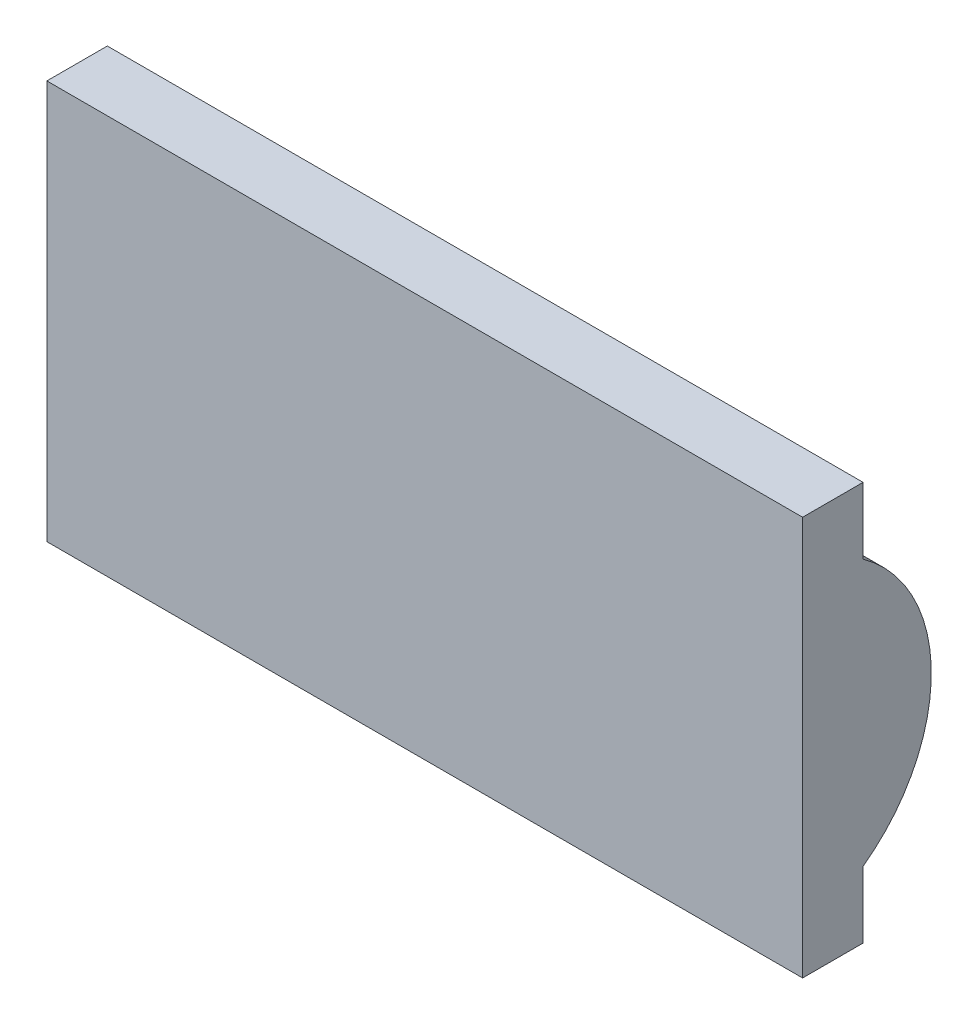
ISO-10303-21;
HEADER;
FILE_DESCRIPTION(('STEP AP214'),'2;1');
FILE_NAME('part.step','',(''),(''),'','','');
FILE_SCHEMA(('AUTOMOTIVE_DESIGN { 1 0 10303 214 1 1 1 1 }'));
ENDSEC;
DATA;
#1=APPLICATION_CONTEXT('core data for automotive mechanical design processes');
#2=APPLICATION_PROTOCOL_DEFINITION('international standard','automotive_design',2000,#1);
#3=PRODUCT_CONTEXT('',#1,'mechanical');
#4=PRODUCT('Part','Part','',(#3));
#5=PRODUCT_RELATED_PRODUCT_CATEGORY('part','',(#4));
#6=PRODUCT_DEFINITION_FORMATION('','',#4);
#7=PRODUCT_DEFINITION_CONTEXT('part definition',#1,'design');
#8=PRODUCT_DEFINITION('design','',#6,#7);
#9=PRODUCT_DEFINITION_SHAPE('','',#8);
#10=(LENGTH_UNIT() NAMED_UNIT(*) SI_UNIT(.MILLI.,.METRE.));
#11=(NAMED_UNIT(*) PLANE_ANGLE_UNIT() SI_UNIT($,.RADIAN.));
#12=(NAMED_UNIT(*) SI_UNIT($,.STERADIAN.) SOLID_ANGLE_UNIT());
#13=UNCERTAINTY_MEASURE_WITH_UNIT(LENGTH_MEASURE(1.E-05),#10,'distance_accuracy_value','');
#14=(GEOMETRIC_REPRESENTATION_CONTEXT(3) GLOBAL_UNCERTAINTY_ASSIGNED_CONTEXT((#13)) GLOBAL_UNIT_ASSIGNED_CONTEXT((#10,
#11,#12)) REPRESENTATION_CONTEXT('',''));
#15=CARTESIAN_POINT('',(0.,0.,0.));
#16=DIRECTION('',(0.,0.,1.));
#17=DIRECTION('',(1.,0.,0.));
#18=AXIS2_PLACEMENT_3D('',#15,#16,#17);
#19=CARTESIAN_POINT('',(62.5,25.6884446982676,0.));
#20=DIRECTION('',(0.,-1.,0.));
#21=DIRECTION('',(0.,0.,-1.));
#22=AXIS2_PLACEMENT_3D('',#19,#20,#21);
#23=PLANE('',#22);
#24=DIRECTION('',(0.,0.,1.));
#25=VECTOR('',#24,1.);
#26=CARTESIAN_POINT('',(0.,25.6884446982676,0.));
#27=LINE('',#26,#25);
#28=CARTESIAN_POINT('',(0.,25.6884446982676,-5.));
#29=VERTEX_POINT('',#28);
#30=CARTESIAN_POINT('',(0.,25.6884446982676,0.));
#31=VERTEX_POINT('',#30);
#32=EDGE_CURVE('E119',#29,#31,#27,.T.);
#33=ORIENTED_EDGE('',*,*,#32,.T.);
#34=DIRECTION('',(-1.,0.,0.));
#35=VECTOR('',#34,1.);
#36=CARTESIAN_POINT('',(62.5,25.6884446982676,0.));
#37=LINE('',#36,#35);
#38=CARTESIAN_POINT('',(62.5,25.6884446982676,0.));
#39=VERTEX_POINT('',#38);
#40=EDGE_CURVE('E11',#39,#31,#37,.T.);
#41=ORIENTED_EDGE('',*,*,#40,.F.);
#42=DIRECTION('',(0.,0.,1.));
#43=VECTOR('',#42,1.);
#44=CARTESIAN_POINT('',(62.5,25.6884446982676,0.));
#45=LINE('',#44,#43);
#46=CARTESIAN_POINT('',(62.5,25.6884446982676,-5.));
#47=VERTEX_POINT('',#46);
#48=EDGE_CURVE('E129',#47,#39,#45,.T.);
#49=ORIENTED_EDGE('',*,*,#48,.F.);
#50=DIRECTION('',(-1.,0.,0.));
#51=VECTOR('',#50,1.);
#52=CARTESIAN_POINT('',(62.5,25.6884446982676,-5.));
#53=LINE('',#52,#51);
#54=EDGE_CURVE('E115',#47,#29,#53,.T.);
#55=ORIENTED_EDGE('',*,*,#54,.T.);
#56=EDGE_LOOP('',(#33,#41,#49,#55));
#57=FACE_BOUND('',#56,.T.);
#58=ADVANCED_FACE('F35',(#57),#23,.F.);
#59=CARTESIAN_POINT('',(62.5,25.6884446982676,0.));
#60=DIRECTION('',(0.,0.,-1.));
#61=DIRECTION('',(0.,1.,0.));
#62=AXIS2_PLACEMENT_3D('',#59,#60,#61);
#63=PLANE('',#62);
#64=DIRECTION('',(0.,-1.,0.));
#65=VECTOR('',#64,1.);
#66=CARTESIAN_POINT('',(0.,25.6884446982676,0.));
#67=LINE('',#66,#65);
#68=CARTESIAN_POINT('',(0.,-7.31155530173237,0.));
#69=VERTEX_POINT('',#68);
#70=EDGE_CURVE('E122',#31,#69,#67,.T.);
#71=ORIENTED_EDGE('',*,*,#70,.T.);
#72=DIRECTION('',(-1.,0.,0.));
#73=VECTOR('',#72,1.);
#74=CARTESIAN_POINT('',(62.5,-7.31155530173237,0.));
#75=LINE('',#74,#73);
#76=CARTESIAN_POINT('',(62.5,-7.31155530173237,0.));
#77=VERTEX_POINT('',#76);
#78=EDGE_CURVE('E43',#77,#69,#75,.T.);
#79=ORIENTED_EDGE('',*,*,#78,.F.);
#80=DIRECTION('',(0.,-1.,0.));
#81=VECTOR('',#80,1.);
#82=CARTESIAN_POINT('',(62.5,25.6884446982676,0.));
#83=LINE('',#82,#81);
#84=EDGE_CURVE('E88',#39,#77,#83,.T.);
#85=ORIENTED_EDGE('',*,*,#84,.F.);
#86=ORIENTED_EDGE('',*,*,#40,.T.);
#87=EDGE_LOOP('',(#71,#79,#85,#86));
#88=FACE_BOUND('',#87,.T.);
#89=ADVANCED_FACE('F153',(#88),#63,.F.);
#90=CARTESIAN_POINT('',(62.5,-7.31155530173237,0.));
#91=DIRECTION('',(0.,1.,0.));
#92=DIRECTION('',(0.,0.,1.));
#93=AXIS2_PLACEMENT_3D('',#90,#91,#92);
#94=PLANE('',#93);
#95=DIRECTION('',(0.,0.,-1.));
#96=VECTOR('',#95,1.);
#97=CARTESIAN_POINT('',(0.,-7.31155530173237,0.));
#98=LINE('',#97,#96);
#99=CARTESIAN_POINT('',(0.,-7.31155530173237,-5.));
#100=VERTEX_POINT('',#99);
#101=EDGE_CURVE('E124',#69,#100,#98,.T.);
#102=ORIENTED_EDGE('',*,*,#101,.T.);
#103=DIRECTION('',(-1.,0.,0.));
#104=VECTOR('',#103,1.);
#105=CARTESIAN_POINT('',(62.5,-7.31155530173237,-5.));
#106=LINE('',#105,#104);
#107=CARTESIAN_POINT('',(62.5,-7.31155530173237,-5.));
#108=VERTEX_POINT('',#107);
#109=EDGE_CURVE('E110',#108,#100,#106,.T.);
#110=ORIENTED_EDGE('',*,*,#109,.F.);
#111=DIRECTION('',(0.,0.,-1.));
#112=VECTOR('',#111,1.);
#113=CARTESIAN_POINT('',(62.5,-7.31155530173237,0.));
#114=LINE('',#113,#112);
#115=EDGE_CURVE('E101',#77,#108,#114,.T.);
#116=ORIENTED_EDGE('',*,*,#115,.F.);
#117=ORIENTED_EDGE('',*,*,#78,.T.);
#118=EDGE_LOOP('',(#102,#110,#116,#117));
#119=FACE_BOUND('',#118,.T.);
#120=ADVANCED_FACE('F135',(#119),#94,.F.);
#121=CARTESIAN_POINT('',(62.5,-7.31155530173237,-5.));
#122=DIRECTION('',(0.,0.,1.));
#123=DIRECTION('',(1.,0.,0.));
#124=AXIS2_PLACEMENT_3D('',#121,#122,#123);
#125=PLANE('',#124);
#126=DIRECTION('',(0.,1.,0.));
#127=VECTOR('',#126,1.);
#128=CARTESIAN_POINT('',(0.,-7.31155530173237,-5.));
#129=LINE('',#128,#127);
#130=CARTESIAN_POINT('',(0.,-1.81155530173237,-5.));
#131=VERTEX_POINT('',#130);
#132=EDGE_CURVE('E109',#100,#131,#129,.T.);
#133=ORIENTED_EDGE('',*,*,#132,.T.);
#134=DIRECTION('',(-1.,0.,0.));
#135=VECTOR('',#134,1.);
#136=CARTESIAN_POINT('',(62.5,-1.81155530173237,-5.));
#137=LINE('',#136,#135);
#138=CARTESIAN_POINT('',(62.5,-1.81155530173237,-5.));
#139=VERTEX_POINT('',#138);
#140=EDGE_CURVE('E106',#139,#131,#137,.T.);
#141=ORIENTED_EDGE('',*,*,#140,.F.);
#142=DIRECTION('',(0.,1.,0.));
#143=VECTOR('',#142,1.);
#144=CARTESIAN_POINT('',(62.5,-7.31155530173237,-5.));
#145=LINE('',#144,#143);
#146=EDGE_CURVE('E95',#108,#139,#145,.T.);
#147=ORIENTED_EDGE('',*,*,#146,.F.);
#148=ORIENTED_EDGE('',*,*,#109,.T.);
#149=EDGE_LOOP('',(#133,#141,#147,#148));
#150=FACE_BOUND('',#149,.T.);
#151=ADVANCED_FACE('F107',(#150),#125,.F.);
#152=CARTESIAN_POINT('',(62.5,9.18844469826763,2.90089764698066));
#153=DIRECTION('',(-1.,0.,0.));
#154=DIRECTION('',(0.,0.,1.));
#155=AXIS2_PLACEMENT_3D('',#152,#153,#154);
#156=CYLINDRICAL_SURFACE('',#155,13.5434184616759);
#157=CARTESIAN_POINT('',(0.,9.18844469826763,2.90089764698066));
#158=DIRECTION('',(1.,0.,0.));
#159=DIRECTION('',(0.,0.,1.));
#160=AXIS2_PLACEMENT_3D('',#157,#158,#159);
#161=CIRCLE('',#160,13.5434184616759);
#162=CARTESIAN_POINT('',(0.,20.1884446982676,-5.));
#163=VERTEX_POINT('',#162);
#164=EDGE_CURVE('E74',#131,#163,#161,.T.);
#165=ORIENTED_EDGE('',*,*,#164,.T.);
#166=DIRECTION('',(-1.,0.,0.));
#167=VECTOR('',#166,1.);
#168=CARTESIAN_POINT('',(62.5,20.1884446982676,-5.));
#169=LINE('',#168,#167);
#170=CARTESIAN_POINT('',(62.5,20.1884446982676,-5.));
#171=VERTEX_POINT('',#170);
#172=EDGE_CURVE('E111',#171,#163,#169,.T.);
#173=ORIENTED_EDGE('',*,*,#172,.F.);
#174=CARTESIAN_POINT('',(62.5,9.18844469826763,2.90089764698066));
#175=DIRECTION('',(1.,0.,0.));
#176=DIRECTION('',(0.,0.,1.));
#177=AXIS2_PLACEMENT_3D('',#174,#175,#176);
#178=CIRCLE('',#177,13.5434184616759);
#179=EDGE_CURVE('E99',#139,#171,#178,.T.);
#180=ORIENTED_EDGE('',*,*,#179,.F.);
#181=ORIENTED_EDGE('',*,*,#140,.T.);
#182=EDGE_LOOP('',(#165,#173,#180,#181));
#183=FACE_BOUND('',#182,.T.);
#184=ADVANCED_FACE('F113',(#183),#156,.T.);
#185=CARTESIAN_POINT('',(62.5,25.6884446982676,-5.));
#186=DIRECTION('',(0.,0.,1.));
#187=DIRECTION('',(1.,0.,0.));
#188=AXIS2_PLACEMENT_3D('',#185,#186,#187);
#189=PLANE('',#188);
#190=DIRECTION('',(0.,1.,0.));
#191=VECTOR('',#190,1.);
#192=CARTESIAN_POINT('',(0.,25.6884446982676,-5.));
#193=LINE('',#192,#191);
#194=EDGE_CURVE('E80',#163,#29,#193,.T.);
#195=ORIENTED_EDGE('',*,*,#194,.T.);
#196=ORIENTED_EDGE('',*,*,#54,.F.);
#197=DIRECTION('',(0.,1.,0.));
#198=VECTOR('',#197,1.);
#199=CARTESIAN_POINT('',(62.5,25.6884446982676,-5.));
#200=LINE('',#199,#198);
#201=EDGE_CURVE('E51',#171,#47,#200,.T.);
#202=ORIENTED_EDGE('',*,*,#201,.F.);
#203=ORIENTED_EDGE('',*,*,#172,.T.);
#204=EDGE_LOOP('',(#195,#196,#202,#203));
#205=FACE_BOUND('',#204,.T.);
#206=ADVANCED_FACE('F142',(#205),#189,.F.);
#207=CARTESIAN_POINT('',(62.5,9.18844469826763,2.90089764698066));
#208=DIRECTION('',(-1.,0.,0.));
#209=DIRECTION('',(0.,0.,1.));
#210=AXIS2_PLACEMENT_3D('',#207,#208,#209);
#211=PLANE('',#210);
#212=ORIENTED_EDGE('',*,*,#48,.T.);
#213=ORIENTED_EDGE('',*,*,#84,.T.);
#214=ORIENTED_EDGE('',*,*,#115,.T.);
#215=ORIENTED_EDGE('',*,*,#146,.T.);
#216=ORIENTED_EDGE('',*,*,#179,.T.);
#217=ORIENTED_EDGE('',*,*,#201,.T.);
#218=EDGE_LOOP('',(#212,#213,#214,#215,#216,#217));
#219=FACE_BOUND('',#218,.T.);
#220=ADVANCED_FACE('F97',(#219),#211,.F.);
#221=CARTESIAN_POINT('',(0.,9.18844469826763,2.90089764698066));
#222=DIRECTION('',(-1.,0.,0.));
#223=DIRECTION('',(0.,0.,1.));
#224=AXIS2_PLACEMENT_3D('',#221,#222,#223);
#225=PLANE('',#224);
#226=ORIENTED_EDGE('',*,*,#32,.F.);
#227=ORIENTED_EDGE('',*,*,#194,.F.);
#228=ORIENTED_EDGE('',*,*,#164,.F.);
#229=ORIENTED_EDGE('',*,*,#132,.F.);
#230=ORIENTED_EDGE('',*,*,#101,.F.);
#231=ORIENTED_EDGE('',*,*,#70,.F.);
#232=EDGE_LOOP('',(#226,#227,#228,#229,#230,#231));
#233=FACE_BOUND('',#232,.T.);
#234=ADVANCED_FACE('F138',(#233),#225,.T.);
#235=CLOSED_SHELL('',(#58,#89,#120,#151,#184,#206,#220,#234));
#236=MANIFOLD_SOLID_BREP('B2',#235);
#237=ADVANCED_BREP_SHAPE_REPRESENTATION('',(#18,#236),#14);
#238=SHAPE_DEFINITION_REPRESENTATION(#9,#237);
ENDSEC;
END-ISO-10303-21;
